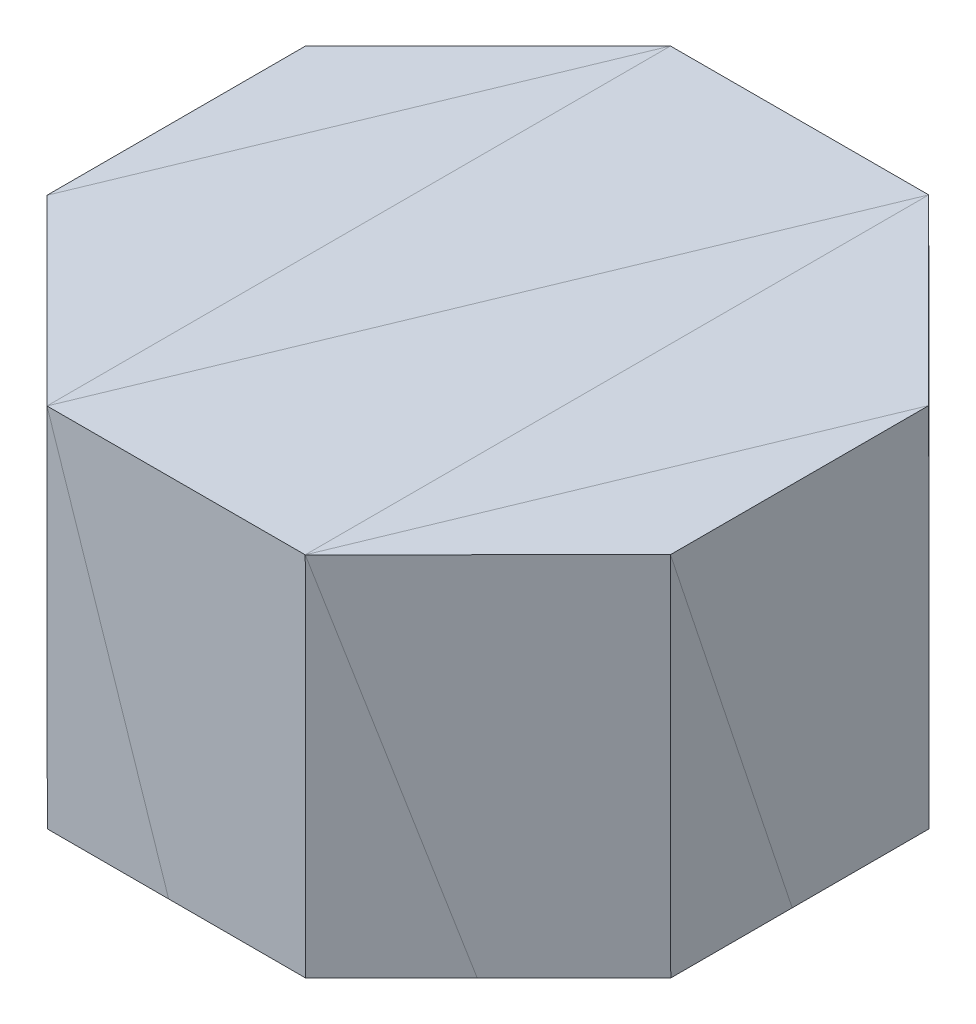
ISO-10303-21;
HEADER;
FILE_DESCRIPTION(('STEP AP214'),'2;1');
FILE_NAME('part.step','',(''),(''),'','','');
FILE_SCHEMA(('AUTOMOTIVE_DESIGN { 1 0 10303 214 1 1 1 1 }'));
ENDSEC;
DATA;
#1=APPLICATION_CONTEXT('core data for automotive mechanical design processes');
#2=APPLICATION_PROTOCOL_DEFINITION('international standard','automotive_design',2000,#1);
#3=PRODUCT_CONTEXT('',#1,'mechanical');
#4=PRODUCT('Part','Part','',(#3));
#5=PRODUCT_RELATED_PRODUCT_CATEGORY('part','',(#4));
#6=PRODUCT_DEFINITION_FORMATION('','',#4);
#7=PRODUCT_DEFINITION_CONTEXT('part definition',#1,'design');
#8=PRODUCT_DEFINITION('design','',#6,#7);
#9=PRODUCT_DEFINITION_SHAPE('','',#8);
#10=(LENGTH_UNIT() NAMED_UNIT(*) SI_UNIT(.MILLI.,.METRE.));
#11=(NAMED_UNIT(*) PLANE_ANGLE_UNIT() SI_UNIT($,.RADIAN.));
#12=(NAMED_UNIT(*) SI_UNIT($,.STERADIAN.) SOLID_ANGLE_UNIT());
#13=UNCERTAINTY_MEASURE_WITH_UNIT(LENGTH_MEASURE(1.E-05),#10,'distance_accuracy_value','');
#14=(GEOMETRIC_REPRESENTATION_CONTEXT(3) GLOBAL_UNCERTAINTY_ASSIGNED_CONTEXT((#13)) GLOBAL_UNIT_ASSIGNED_CONTEXT((#10,
#11,#12)) REPRESENTATION_CONTEXT('',''));
#15=CARTESIAN_POINT('',(0.,0.,0.));
#16=DIRECTION('',(0.,0.,1.));
#17=DIRECTION('',(1.,0.,0.));
#18=AXIS2_PLACEMENT_3D('',#15,#16,#17);
#19=CARTESIAN_POINT('',(-0.0592231518994801,74.9999668549388,0.));
#20=DIRECTION('',(-0.000789642128111586,0.999999688232606,0.));
#21=DIRECTION('',(-0.999999688232606,-0.000789642128111586,0.));
#22=AXIS2_PLACEMENT_3D('',#19,#20,#21);
#23=PLANE('',#22);
#24=DIRECTION('',(-0.999999688232606,-0.000789642128111586,0.));
#25=VECTOR('',#24,1.);
#26=CARTESIAN_POINT('',(14.0829924494028,75.011134147644,9.99999977648258));
#27=LINE('',#26,#25);
#28=CARTESIAN_POINT('',(14.0829924494028,75.011134147644,9.99999977648258));
#29=VERTEX_POINT('',#28);
#30=CARTESIAN_POINT('',(5.79872354865074,75.0045925378799,9.99999977648258));
#31=VERTEX_POINT('',#30);
#32=EDGE_CURVE('E137',#29,#31,#27,.T.);
#33=ORIENTED_EDGE('',*,*,#32,.F.);
#34=DIRECTION('',(0.,0.,1.));
#35=VECTOR('',#34,1.);
#36=CARTESIAN_POINT('',(14.0829924494028,75.011134147644,-9.99999977648258));
#37=LINE('',#36,#35);
#38=CARTESIAN_POINT('',(14.0829924494028,75.011134147644,-9.99999977648258));
#39=VERTEX_POINT('',#38);
#40=EDGE_CURVE('E208',#39,#29,#37,.T.);
#41=ORIENTED_EDGE('',*,*,#40,.F.);
#42=DIRECTION('',(0.382683329665312,0.000302182973040543,-0.923879525631844));
#43=VECTOR('',#42,1.);
#44=CARTESIAN_POINT('',(5.79872354865074,75.0045925378799,9.99999977648258));
#45=LINE('',#44,#43);
#46=EDGE_CURVE('E167',#31,#39,#45,.T.);
#47=ORIENTED_EDGE('',*,*,#46,.F.);
#48=EDGE_LOOP('',(#33,#41,#47));
#49=FACE_BOUND('',#48,.T.);
#50=ADVANCED_FACE('F34',(#49),#23,.T.);
#51=CARTESIAN_POINT('',(12.0710626178145,0.00951797525365743,12.0710672326298));
#52=DIRECTION('',(-0.70710653611534,-0.000557550128396545,-0.707106806444981));
#53=DIRECTION('',(-0.707106916351376,0.,0.707106646021693));
#54=AXIS2_PLACEMENT_3D('',#51,#52,#53);
#55=PLANE('',#54);
#56=DIRECTION('',(-0.223169281473355,0.949065030133473,0.222420863195019));
#57=VECTOR('',#56,1.);
#58=CARTESIAN_POINT('',(19.9605673551559,50.0157549977303,4.1421358473599));
#59=LINE('',#58,#57);
#60=CARTESIAN_POINT('',(16.8463148957791,63.259639123219,7.24594438072429));
#61=VERTEX_POINT('',#60);
#62=EDGE_CURVE('E151',#61,#29,#59,.T.);
#63=ORIENTED_EDGE('',*,*,#62,.F.);
#64=DIRECTION('',(0.707106916351376,0.,-0.707106646021693));
#65=VECTOR('',#64,1.);
#66=CARTESIAN_POINT('',(12.0461264180455,63.259639123219,12.0461310233275));
#67=LINE('',#66,#65);
#68=CARTESIAN_POINT('',(19.9501246157419,63.259639123219,4.1421358473599));
#69=VERTEX_POINT('',#68);
#70=EDGE_CURVE('E89',#61,#69,#67,.T.);
#71=ORIENTED_EDGE('',*,*,#70,.T.);
#72=DIRECTION('',(0.000788494981446942,-0.999999689137784,0.));
#73=VECTOR('',#72,1.);
#74=CARTESIAN_POINT('',(19.9408549815416,75.0157460570335,4.1421358473599));
#75=LINE('',#74,#73);
#76=CARTESIAN_POINT('',(19.9408549815416,75.0157460570335,4.1421358473599));
#77=VERTEX_POINT('',#76);
#78=EDGE_CURVE('E83',#77,#69,#75,.T.);
#79=ORIENTED_EDGE('',*,*,#78,.F.);
#80=DIRECTION('',(0.707106587296986,0.000556706732436522,-0.707106755927862));
#81=VECTOR('',#80,1.);
#82=CARTESIAN_POINT('',(14.0829924494028,75.011134147644,9.99999977648258));
#83=LINE('',#82,#81);
#84=EDGE_CURVE('E153',#29,#77,#83,.T.);
#85=ORIENTED_EDGE('',*,*,#84,.F.);
#86=EDGE_LOOP('',(#63,#71,#79,#85));
#87=FACE_BOUND('',#86,.T.);
#88=ADVANCED_FACE('F366',(#87),#55,.F.);
#89=CARTESIAN_POINT('',(0.,0.,9.99999977648258));
#90=DIRECTION('',(0.,0.,-1.));
#91=DIRECTION('',(-1.,0.,0.));
#92=AXIS2_PLACEMENT_3D('',#89,#90,#91);
#93=PLANE('',#92);
#94=DIRECTION('',(-0.315299108110476,0.94899234581989,0.));
#95=VECTOR('',#94,1.);
#96=CARTESIAN_POINT('',(14.1027048230171,50.0111356377602,9.99999977648258));
#97=LINE('',#96,#95);
#98=CARTESIAN_POINT('',(9.70093978121931,63.259639123219,9.99999977648258));
#99=VERTEX_POINT('',#98);
#100=EDGE_CURVE('E146',#99,#31,#97,.T.);
#101=ORIENTED_EDGE('',*,*,#100,.F.);
#102=DIRECTION('',(-1.,0.,0.));
#103=VECTOR('',#102,1.);
#104=CARTESIAN_POINT('',(-3.27994698003474,63.259639123219,9.99999977648258));
#105=LINE('',#104,#103);
#106=CARTESIAN_POINT('',(14.092258444373,63.259639123219,9.99999977648258));
#107=VERTEX_POINT('',#106);
#108=EDGE_CURVE('E132',#107,#99,#105,.T.);
#109=ORIENTED_EDGE('',*,*,#108,.F.);
#110=DIRECTION('',(0.000788494746457258,-0.999999689137969,0.));
#111=VECTOR('',#110,1.);
#112=CARTESIAN_POINT('',(14.0829924494028,75.011134147644,9.99999977648258));
#113=LINE('',#112,#111);
#114=EDGE_CURVE('E144',#29,#107,#113,.T.);
#115=ORIENTED_EDGE('',*,*,#114,.F.);
#116=ORIENTED_EDGE('',*,*,#32,.T.);
#117=EDGE_LOOP('',(#101,#109,#115,#116));
#118=FACE_BOUND('',#117,.T.);
#119=ADVANCED_FACE('F142',(#118),#93,.F.);
#120=CARTESIAN_POINT('',(12.0710626019132,0.00951797240454148,12.0710672288321));
#121=DIRECTION('',(0.707106535760899,0.000557549961954174,0.707106806799553));
#122=DIRECTION('',(0.707106916705883,0.,-0.707106645667186));
#123=AXIS2_PLACEMENT_3D('',#120,#121,#122);
#124=PLANE('',#123);
#125=DIRECTION('',(-0.707106916705883,0.,0.707106645667186));
#126=VECTOR('',#125,1.);
#127=CARTESIAN_POINT('',(12.0461264095996,63.259639123219,12.0461310269602));
#128=LINE('',#127,#126);
#129=EDGE_CURVE('E129',#61,#107,#128,.T.);
#130=ORIENTED_EDGE('',*,*,#129,.F.);
#131=ORIENTED_EDGE('',*,*,#62,.T.);
#132=ORIENTED_EDGE('',*,*,#114,.T.);
#133=EDGE_LOOP('',(#130,#131,#132));
#134=FACE_BOUND('',#133,.T.);
#135=ADVANCED_FACE('F150',(#134),#124,.T.);
#136=CARTESIAN_POINT('',(19.9999921047349,0.0157698983058275,0.));
#137=DIRECTION('',(0.999999689137784,0.000788494981446942,0.));
#138=DIRECTION('',(-0.000788494981446942,0.999999689137784,0.));
#139=AXIS2_PLACEMENT_3D('',#136,#137,#138);
#140=PLANE('',#139);
#141=DIRECTION('',(0.,0.,1.));
#142=VECTOR('',#141,1.);
#143=CARTESIAN_POINT('',(19.9501246157419,63.259639123219,0.));
#144=LINE('',#143,#142);
#145=CARTESIAN_POINT('',(19.9501246157419,63.259639123219,0.246503097697093));
#146=VERTEX_POINT('',#145);
#147=EDGE_CURVE('E94',#146,#69,#144,.T.);
#148=ORIENTED_EDGE('',*,*,#147,.F.);
#149=DIRECTION('',(0.00074847150276844,-0.949240372745852,-0.314550718549052));
#150=VECTOR('',#149,1.);
#151=CARTESIAN_POINT('',(19.9408549815416,75.0157460570335,4.1421358473599));
#152=LINE('',#151,#150);
#153=EDGE_CURVE('E219',#77,#146,#152,.T.);
#154=ORIENTED_EDGE('',*,*,#153,.F.);
#155=ORIENTED_EDGE('',*,*,#78,.T.);
#156=EDGE_LOOP('',(#148,#154,#155));
#157=FACE_BOUND('',#156,.T.);
#158=ADVANCED_FACE('F388',(#157),#140,.T.);
#159=CARTESIAN_POINT('',(-0.0590476821036765,75.0000000851236,0.));
#160=DIRECTION('',(-0.00078730218315278,0.999999690077588,0.));
#161=DIRECTION('',(-0.999999690077588,-0.00078730218315278,0.));
#162=AXIS2_PLACEMENT_3D('',#159,#160,#161);
#163=PLANE('',#162);
#164=ORIENTED_EDGE('',*,*,#84,.T.);
#165=DIRECTION('',(0.,0.,1.));
#166=VECTOR('',#165,1.);
#167=CARTESIAN_POINT('',(19.9408549815416,75.0157460570335,-4.1421358473599));
#168=LINE('',#167,#166);
#169=CARTESIAN_POINT('',(19.9408549815416,75.0157460570335,-4.1421358473599));
#170=VERTEX_POINT('',#169);
#171=EDGE_CURVE('E216',#170,#77,#168,.T.);
#172=ORIENTED_EDGE('',*,*,#171,.F.);
#173=DIRECTION('',(0.382683312162967,0.00030128750049779,-0.923879533174008));
#174=VECTOR('',#173,1.);
#175=CARTESIAN_POINT('',(14.0829924494028,75.011134147644,9.99999977648258));
#176=LINE('',#175,#174);
#177=EDGE_CURVE('E210',#29,#170,#176,.T.);
#178=ORIENTED_EDGE('',*,*,#177,.F.);
#179=EDGE_LOOP('',(#164,#172,#178));
#180=FACE_BOUND('',#179,.T.);
#181=ADVANCED_FACE('F225',(#180),#163,.T.);
#182=CARTESIAN_POINT('',(19.9999921047349,0.0157698983058275,0.));
#183=DIRECTION('',(-0.999999689137784,-0.000788494981446942,0.));
#184=DIRECTION('',(0.000788494981446942,-0.999999689137784,0.));
#185=AXIS2_PLACEMENT_3D('',#182,#183,#184);
#186=PLANE('',#185);
#187=ORIENTED_EDGE('',*,*,#153,.T.);
#188=DIRECTION('',(0.,0.,-1.));
#189=VECTOR('',#188,1.);
#190=CARTESIAN_POINT('',(19.9501246157419,63.259639123219,0.));
#191=LINE('',#190,#189);
#192=CARTESIAN_POINT('',(19.9501246157419,63.259639123219,-4.1421358473599));
#193=VERTEX_POINT('',#192);
#194=EDGE_CURVE('E230',#146,#193,#191,.T.);
#195=ORIENTED_EDGE('',*,*,#194,.T.);
#196=DIRECTION('',(0.000788494981446942,-0.999999689137784,0.));
#197=VECTOR('',#196,1.);
#198=CARTESIAN_POINT('',(19.9408549815416,75.0157460570335,-4.1421358473599));
#199=LINE('',#198,#197);
#200=EDGE_CURVE('E213',#170,#193,#199,.T.);
#201=ORIENTED_EDGE('',*,*,#200,.F.);
#202=ORIENTED_EDGE('',*,*,#171,.T.);
#203=EDGE_LOOP('',(#187,#195,#201,#202));
#204=FACE_BOUND('',#203,.T.);
#205=ADVANCED_FACE('F228',(#204),#186,.F.);
#206=CARTESIAN_POINT('',(12.0710626077857,0.00951797524574976,-12.0710672347068));
#207=DIRECTION('',(0.707106535760768,0.000557550128116967,-0.707106806799553));
#208=DIRECTION('',(-0.707106916705948,0.,-0.707106645667121));
#209=AXIS2_PLACEMENT_3D('',#206,#207,#208);
#210=PLANE('',#209);
#211=DIRECTION('',(0.707106916705948,0.,0.707106645667121));
#212=VECTOR('',#211,1.);
#213=CARTESIAN_POINT('',(12.0461264080417,63.259639123219,-12.0461310254045));
#214=LINE('',#213,#212);
#215=CARTESIAN_POINT('',(17.1960044756374,63.259639123219,-6.89625493179163));
#216=VERTEX_POINT('',#215);
#217=EDGE_CURVE('E234',#216,#193,#214,.T.);
#218=ORIENTED_EDGE('',*,*,#217,.F.);
#219=DIRECTION('',(-0.221672390943262,-0.94941576111259,-0.222420915483458));
#220=VECTOR('',#219,1.);
#221=CARTESIAN_POINT('',(19.9408549815416,75.0157460570335,-4.1421358473599));
#222=LINE('',#221,#220);
#223=EDGE_CURVE('E205',#170,#216,#222,.T.);
#224=ORIENTED_EDGE('',*,*,#223,.F.);
#225=ORIENTED_EDGE('',*,*,#200,.T.);
#226=EDGE_LOOP('',(#218,#224,#225));
#227=FACE_BOUND('',#226,.T.);
#228=ADVANCED_FACE('F233',(#227),#210,.T.);
#229=CARTESIAN_POINT('',(-0.0590476821036765,75.0000000851236,0.));
#230=DIRECTION('',(0.00078730218315278,-0.999999690077588,0.));
#231=DIRECTION('',(0.999999690077588,0.00078730218315278,0.));
#232=AXIS2_PLACEMENT_3D('',#229,#230,#231);
#233=PLANE('',#232);
#234=ORIENTED_EDGE('',*,*,#40,.T.);
#235=ORIENTED_EDGE('',*,*,#177,.T.);
#236=DIRECTION('',(0.707106587296986,0.000556706732436522,0.707106755927862));
#237=VECTOR('',#236,1.);
#238=CARTESIAN_POINT('',(14.0829924494028,75.011134147644,-9.99999977648258));
#239=LINE('',#238,#237);
#240=EDGE_CURVE('E202',#39,#170,#239,.T.);
#241=ORIENTED_EDGE('',*,*,#240,.F.);
#242=EDGE_LOOP('',(#234,#235,#241));
#243=FACE_BOUND('',#242,.T.);
#244=ADVANCED_FACE('F242',(#243),#233,.F.);
#245=CARTESIAN_POINT('',(12.0710626090047,0.00951797241013305,-12.0710672238177));
#246=DIRECTION('',(-0.707106536115471,-0.000557549962233752,0.707106806444981));
#247=DIRECTION('',(0.707106916351311,0.,0.707106646021759));
#248=AXIS2_PLACEMENT_3D('',#245,#246,#247);
#249=PLANE('',#248);
#250=ORIENTED_EDGE('',*,*,#223,.T.);
#251=DIRECTION('',(-0.707106916351311,0.,-0.707106646021759));
#252=VECTOR('',#251,1.);
#253=CARTESIAN_POINT('',(12.046126416666,63.259639123219,-12.0461310219458));
#254=LINE('',#253,#252);
#255=CARTESIAN_POINT('',(14.092258444373,63.259639123219,-9.99999977648258));
#256=VERTEX_POINT('',#255);
#257=EDGE_CURVE('E239',#216,#256,#254,.T.);
#258=ORIENTED_EDGE('',*,*,#257,.T.);
#259=DIRECTION('',(0.000788494746457258,-0.999999689137969,0.));
#260=VECTOR('',#259,1.);
#261=CARTESIAN_POINT('',(14.0829924494028,75.011134147644,-9.99999977648258));
#262=LINE('',#261,#260);
#263=EDGE_CURVE('E199',#39,#256,#262,.T.);
#264=ORIENTED_EDGE('',*,*,#263,.F.);
#265=ORIENTED_EDGE('',*,*,#240,.T.);
#266=EDGE_LOOP('',(#250,#258,#264,#265));
#267=FACE_BOUND('',#266,.T.);
#268=ADVANCED_FACE('F237',(#267),#249,.F.);
#269=CARTESIAN_POINT('',(0.,0.,-9.99999977648258));
#270=DIRECTION('',(0.,0.,-1.));
#271=DIRECTION('',(-1.,0.,0.));
#272=AXIS2_PLACEMENT_3D('',#269,#270,#271);
#273=PLANE('',#272);
#274=DIRECTION('',(-1.,0.,0.));
#275=VECTOR('',#274,1.);
#276=CARTESIAN_POINT('',(-3.27994698003474,63.259639123219,-9.99999977648258));
#277=LINE('',#276,#275);
#278=CARTESIAN_POINT('',(10.1991713808464,63.259639123219,-9.99999977648258));
#279=VERTEX_POINT('',#278);
#280=EDGE_CURVE('E247',#256,#279,#277,.T.);
#281=ORIENTED_EDGE('',*,*,#280,.T.);
#282=DIRECTION('',(-0.313802044533206,-0.94948842902206,0.));
#283=VECTOR('',#282,1.);
#284=CARTESIAN_POINT('',(14.0829924494028,75.011134147644,-9.99999977648258));
#285=LINE('',#284,#283);
#286=EDGE_CURVE('E195',#39,#279,#285,.T.);
#287=ORIENTED_EDGE('',*,*,#286,.F.);
#288=ORIENTED_EDGE('',*,*,#263,.T.);
#289=EDGE_LOOP('',(#281,#287,#288));
#290=FACE_BOUND('',#289,.T.);
#291=ADVANCED_FACE('F246',(#290),#273,.T.);
#292=CARTESIAN_POINT('',(-0.0592231518994801,74.9999668549388,0.));
#293=DIRECTION('',(0.000789642128111586,-0.999999688232606,0.));
#294=DIRECTION('',(0.999999688232606,0.000789642128111586,0.));
#295=AXIS2_PLACEMENT_3D('',#292,#293,#294);
#296=PLANE('',#295);
#297=DIRECTION('',(0.,0.,-1.));
#298=VECTOR('',#297,1.);
#299=CARTESIAN_POINT('',(5.79872354865074,75.0045925378799,9.99999977648258));
#300=LINE('',#299,#298);
#301=CARTESIAN_POINT('',(5.79872354865074,75.0045925378799,-9.99999977648258));
#302=VERTEX_POINT('',#301);
#303=EDGE_CURVE('E164',#31,#302,#300,.T.);
#304=ORIENTED_EDGE('',*,*,#303,.F.);
#305=ORIENTED_EDGE('',*,*,#46,.T.);
#306=DIRECTION('',(0.999999688232606,0.000789642128111586,0.));
#307=VECTOR('',#306,1.);
#308=CARTESIAN_POINT('',(5.79872354865074,75.0045925378799,-9.99999977648258));
#309=LINE('',#308,#307);
#310=EDGE_CURVE('E169',#302,#39,#309,.T.);
#311=ORIENTED_EDGE('',*,*,#310,.F.);
#312=EDGE_LOOP('',(#304,#305,#311));
#313=FACE_BOUND('',#312,.T.);
#314=ADVANCED_FACE('F166',(#313),#296,.F.);
#315=CARTESIAN_POINT('',(0.,0.,-9.99999977648258));
#316=DIRECTION('',(0.,0.,1.));
#317=DIRECTION('',(1.,0.,0.));
#318=AXIS2_PLACEMENT_3D('',#315,#316,#317);
#319=PLANE('',#318);
#320=ORIENTED_EDGE('',*,*,#286,.T.);
#321=CARTESIAN_POINT('',(5.80798482726818,63.259639123219,-9.99999977648258));
#322=VERTEX_POINT('',#321);
#323=EDGE_CURVE('E147',#279,#322,#277,.T.);
#324=ORIENTED_EDGE('',*,*,#323,.T.);
#325=DIRECTION('',(0.000788532351828952,-0.999999689108317,0.));
#326=VECTOR('',#325,1.);
#327=CARTESIAN_POINT('',(5.79872354865074,75.0045925378799,-9.99999977648258));
#328=LINE('',#327,#326);
#329=EDGE_CURVE('E191',#302,#322,#328,.T.);
#330=ORIENTED_EDGE('',*,*,#329,.F.);
#331=ORIENTED_EDGE('',*,*,#310,.T.);
#332=EDGE_LOOP('',(#320,#324,#330,#331));
#333=FACE_BOUND('',#332,.T.);
#334=ADVANCED_FACE('F250',(#333),#319,.F.);
#335=CARTESIAN_POINT('',(-2.0710669206932,-0.00163310377748774,-2.07106779306777));
#336=DIRECTION('',(-0.707106522346081,-0.000557576542405056,-0.707106820193407));
#337=DIRECTION('',(-0.707106930110218,0.,0.707106632262845));
#338=AXIS2_PLACEMENT_3D('',#335,#336,#337);
#339=PLANE('',#338);
#340=DIRECTION('',(0.707106930110218,0.,-0.707106632262845));
#341=VECTOR('',#340,1.);
#342=CARTESIAN_POINT('',(-2.09600869782584,63.259639123219,-2.09600958070638));
#343=LINE('',#342,#341);
#344=CARTESIAN_POINT('',(3.05647712394585,63.259639123219,-7.24849323214951));
#345=VERTEX_POINT('',#344);
#346=EDGE_CURVE('E255',#345,#322,#343,.T.);
#347=ORIENTED_EDGE('',*,*,#346,.F.);
#348=DIRECTION('',(-0.221672395099996,-0.949415752833357,0.222420946681064));
#349=VECTOR('',#348,1.);
#350=CARTESIAN_POINT('',(5.79872354865074,75.0045925378799,-9.99999977648258));
#351=LINE('',#350,#349);
#352=EDGE_CURVE('E257',#302,#345,#351,.T.);
#353=ORIENTED_EDGE('',*,*,#352,.F.);
#354=ORIENTED_EDGE('',*,*,#329,.T.);
#355=EDGE_LOOP('',(#347,#353,#354));
#356=FACE_BOUND('',#355,.T.);
#357=ADVANCED_FACE('F254',(#356),#339,.T.);
#358=CARTESIAN_POINT('',(0.,0.,9.99999977648258));
#359=DIRECTION('',(0.,0.,1.));
#360=DIRECTION('',(1.,0.,0.));
#361=AXIS2_PLACEMENT_3D('',#358,#359,#360);
#362=PLANE('',#361);
#363=CARTESIAN_POINT('',(5.80798482726818,63.259639123219,9.99999977648258));
#364=VERTEX_POINT('',#363);
#365=EDGE_CURVE('E148',#99,#364,#105,.T.);
#366=ORIENTED_EDGE('',*,*,#365,.F.);
#367=ORIENTED_EDGE('',*,*,#100,.T.);
#368=DIRECTION('',(-0.000788532351828952,0.999999689108317,0.));
#369=VECTOR('',#368,1.);
#370=CARTESIAN_POINT('',(5.81843685358763,50.004605203867,9.99999977648258));
#371=LINE('',#370,#369);
#372=EDGE_CURVE('E174',#364,#31,#371,.T.);
#373=ORIENTED_EDGE('',*,*,#372,.F.);
#374=EDGE_LOOP('',(#366,#367,#373));
#375=FACE_BOUND('',#374,.T.);
#376=ADVANCED_FACE('F295',(#375),#362,.T.);
#377=CARTESIAN_POINT('',(-0.0590476681621012,74.9999807002801,0.));
#378=DIRECTION('',(0.000787302200754888,-0.999999690077574,0.));
#379=DIRECTION('',(0.999999690077574,0.000787302200754889,0.));
#380=AXIS2_PLACEMENT_3D('',#377,#378,#379);
#381=PLANE('',#380);
#382=DIRECTION('',(-0.707106579392409,-0.000556706738659807,-0.707106763832432));
#383=VECTOR('',#382,1.);
#384=CARTESIAN_POINT('',(5.79872354865074,75.0045925378799,9.99999977648258));
#385=LINE('',#384,#383);
#386=CARTESIAN_POINT('',(-0.059138852520846,74.9999806284904,4.1421358473599));
#387=VERTEX_POINT('',#386);
#388=EDGE_CURVE('E177',#31,#387,#385,.T.);
#389=ORIENTED_EDGE('',*,*,#388,.F.);
#390=ORIENTED_EDGE('',*,*,#303,.T.);
#391=DIRECTION('',(0.382683304860094,0.000301287501484259,-0.923879536198956));
#392=VECTOR('',#391,1.);
#393=CARTESIAN_POINT('',(-0.0591388525208458,74.9999806284904,4.1421358473599));
#394=LINE('',#393,#392);
#395=EDGE_CURVE('E179',#387,#302,#394,.T.);
#396=ORIENTED_EDGE('',*,*,#395,.F.);
#397=EDGE_LOOP('',(#389,#390,#396));
#398=FACE_BOUND('',#397,.T.);
#399=ADVANCED_FACE('F178',(#398),#381,.F.);
#400=CARTESIAN_POINT('',(-2.07106674131383,-0.00163310363604125,2.07106748684792));
#401=DIRECTION('',(0.707106543999087,0.000557576559479158,-0.707106798540395));
#402=DIRECTION('',(-0.70710690845721,0.,-0.707106653915862));
#403=AXIS2_PLACEMENT_3D('',#400,#401,#402);
#404=PLANE('',#403);
#405=DIRECTION('',(-0.223169340307992,0.949065009654656,-0.22242089154507));
#406=VECTOR('',#405,1.);
#407=CARTESIAN_POINT('',(5.81843685358763,50.004605203867,9.99999977648258));
#408=LINE('',#407,#406);
#409=CARTESIAN_POINT('',(2.70156167069764,63.259639123219,6.89357773814909));
#410=VERTEX_POINT('',#409);
#411=EDGE_CURVE('E184',#410,#387,#408,.T.);
#412=ORIENTED_EDGE('',*,*,#411,.F.);
#413=DIRECTION('',(0.70710690845721,0.,0.707106653915862));
#414=VECTOR('',#413,1.);
#415=CARTESIAN_POINT('',(-2.09600851997395,63.259639123219,2.09600927448648));
#416=LINE('',#415,#414);
#417=EDGE_CURVE('E284',#410,#364,#416,.T.);
#418=ORIENTED_EDGE('',*,*,#417,.T.);
#419=ORIENTED_EDGE('',*,*,#372,.T.);
#420=ORIENTED_EDGE('',*,*,#388,.T.);
#421=EDGE_LOOP('',(#412,#418,#419,#420));
#422=FACE_BOUND('',#421,.T.);
#423=ADVANCED_FACE('F294',(#422),#404,.F.);
#424=CARTESIAN_POINT('',(-2.07106727947532,-0.00163307433983438,2.0710681518266));
#425=DIRECTION('',(-0.707106522354082,-0.000557566395176945,0.707106820193407));
#426=DIRECTION('',(0.707106930106217,0.,0.707106632266846));
#427=AXIS2_PLACEMENT_3D('',#424,#425,#426);
#428=PLANE('',#427);
#429=DIRECTION('',(-0.707106930106217,0.,-0.707106632266846));
#430=VECTOR('',#429,1.);
#431=CARTESIAN_POINT('',(-2.09600860268576,63.259639123219,2.09600948554253));
#432=LINE('',#431,#430);
#433=CARTESIAN_POINT('',(-0.0498813790224433,63.259639123219,4.1421358473599));
#434=VERTEX_POINT('',#433);
#435=EDGE_CURVE('E287',#410,#434,#432,.T.);
#436=ORIENTED_EDGE('',*,*,#435,.F.);
#437=ORIENTED_EDGE('',*,*,#411,.T.);
#438=DIRECTION('',(-0.000788518001480544,0.999999689119632,0.));
#439=VECTOR('',#438,1.);
#440=CARTESIAN_POINT('',(-0.0394259004679043,49.9999858438969,4.1421358473599));
#441=LINE('',#440,#439);
#442=EDGE_CURVE('E266',#434,#387,#441,.T.);
#443=ORIENTED_EDGE('',*,*,#442,.F.);
#444=EDGE_LOOP('',(#436,#437,#443));
#445=FACE_BOUND('',#444,.T.);
#446=ADVANCED_FACE('F320',(#445),#428,.T.);
#447=CARTESIAN_POINT('',(-0.0590476681621012,74.9999807002801,0.));
#448=DIRECTION('',(0.000787302200754888,-0.999999690077574,0.));
#449=DIRECTION('',(0.999999690077574,0.000787302200754888,0.));
#450=AXIS2_PLACEMENT_3D('',#447,#448,#449);
#451=PLANE('',#450);
#452=DIRECTION('',(0.,0.,-1.));
#453=VECTOR('',#452,1.);
#454=CARTESIAN_POINT('',(-0.0591388525208458,74.9999806284904,4.1421358473599));
#455=LINE('',#454,#453);
#456=CARTESIAN_POINT('',(-0.0591388525208458,74.9999806284904,-4.1421358473599));
#457=VERTEX_POINT('',#456);
#458=EDGE_CURVE('E262',#387,#457,#455,.T.);
#459=ORIENTED_EDGE('',*,*,#458,.F.);
#460=ORIENTED_EDGE('',*,*,#395,.T.);
#461=DIRECTION('',(0.707106579392409,0.000556706738659807,-0.707106763832432));
#462=VECTOR('',#461,1.);
#463=CARTESIAN_POINT('',(-0.0591388525208458,74.9999806284904,-4.1421358473599));
#464=LINE('',#463,#462);
#465=EDGE_CURVE('E261',#457,#302,#464,.T.);
#466=ORIENTED_EDGE('',*,*,#465,.F.);
#467=EDGE_LOOP('',(#459,#460,#466));
#468=FACE_BOUND('',#467,.T.);
#469=ADVANCED_FACE('F272',(#468),#451,.F.);
#470=CARTESIAN_POINT('',(7.00519001135164E-10,5.52372014495861E-13,0.));
#471=DIRECTION('',(0.999999689119632,0.000788518001480544,0.));
#472=DIRECTION('',(-0.000788518001480544,0.999999689119632,0.));
#473=AXIS2_PLACEMENT_3D('',#470,#471,#472);
#474=PLANE('',#473);
#475=DIRECTION('',(-0.000748493365357289,0.949240386725483,-0.314550676309776));
#476=VECTOR('',#475,1.);
#477=CARTESIAN_POINT('',(-0.0394259004679043,49.9999858438969,4.1421358473599));
#478=LINE('',#477,#476);
#479=CARTESIAN_POINT('',(-0.0498813790224433,63.259639123219,-0.251727883018971));
#480=VERTEX_POINT('',#479);
#481=EDGE_CURVE('E55',#480,#457,#478,.T.);
#482=ORIENTED_EDGE('',*,*,#481,.F.);
#483=DIRECTION('',(0.,0.,1.));
#484=VECTOR('',#483,1.);
#485=CARTESIAN_POINT('',(-0.0498813790224433,63.259639123219,0.));
#486=LINE('',#485,#484);
#487=EDGE_CURVE('E47',#480,#434,#486,.T.);
#488=ORIENTED_EDGE('',*,*,#487,.T.);
#489=ORIENTED_EDGE('',*,*,#442,.T.);
#490=ORIENTED_EDGE('',*,*,#458,.T.);
#491=EDGE_LOOP('',(#482,#488,#489,#490));
#492=FACE_BOUND('',#491,.T.);
#493=ADVANCED_FACE('F312',(#492),#474,.F.);
#494=CARTESIAN_POINT('',(-2.07106727947533,-0.00163307433983439,-2.07106802498622));
#495=DIRECTION('',(0.707106544007082,0.00055756641225073,0.707106798540402));
#496=DIRECTION('',(0.707106908453215,0.,-0.707106653919857));
#497=AXIS2_PLACEMENT_3D('',#494,#495,#496);
#498=PLANE('',#497);
#499=ORIENTED_EDGE('',*,*,#352,.T.);
#500=DIRECTION('',(-0.707106908453215,0.,0.707106653919857));
#501=VECTOR('',#500,1.);
#502=CARTESIAN_POINT('',(-2.09600860421327,63.259639123219,-2.09600935870216));
#503=LINE('',#502,#501);
#504=CARTESIAN_POINT('',(-0.0498813790224433,63.259639123219,-4.1421358473599));
#505=VERTEX_POINT('',#504);
#506=EDGE_CURVE('E275',#345,#505,#503,.T.);
#507=ORIENTED_EDGE('',*,*,#506,.T.);
#508=DIRECTION('',(0.000788518001480544,-0.999999689119632,0.));
#509=VECTOR('',#508,1.);
#510=CARTESIAN_POINT('',(-0.0591388525208458,74.9999806284904,-4.1421358473599));
#511=LINE('',#510,#509);
#512=EDGE_CURVE('E41',#457,#505,#511,.T.);
#513=ORIENTED_EDGE('',*,*,#512,.F.);
#514=ORIENTED_EDGE('',*,*,#465,.T.);
#515=EDGE_LOOP('',(#499,#507,#513,#514));
#516=FACE_BOUND('',#515,.T.);
#517=ADVANCED_FACE('F274',(#516),#498,.F.);
#518=CARTESIAN_POINT('',(7.00518994358902E-10,5.52372009152656E-13,0.));
#519=DIRECTION('',(-0.999999689119632,-0.000788518001480544,0.));
#520=DIRECTION('',(0.000788518001480544,-0.999999689119632,0.));
#521=AXIS2_PLACEMENT_3D('',#518,#519,#520);
#522=PLANE('',#521);
#523=DIRECTION('',(0.,0.,-1.));
#524=VECTOR('',#523,1.);
#525=CARTESIAN_POINT('',(-0.0498813790224433,63.259639123219,0.));
#526=LINE('',#525,#524);
#527=EDGE_CURVE('E11',#480,#505,#526,.T.);
#528=ORIENTED_EDGE('',*,*,#527,.F.);
#529=ORIENTED_EDGE('',*,*,#481,.T.);
#530=ORIENTED_EDGE('',*,*,#512,.T.);
#531=EDGE_LOOP('',(#528,#529,#530));
#532=FACE_BOUND('',#531,.T.);
#533=ADVANCED_FACE('F304',(#532),#522,.T.);
#534=CARTESIAN_POINT('',(-3.27994698003474,63.259639123219,-9.99999977648258));
#535=DIRECTION('',(0.,1.,0.));
#536=DIRECTION('',(0.,0.,1.));
#537=AXIS2_PLACEMENT_3D('',#534,#535,#536);
#538=PLANE('',#537);
#539=ORIENTED_EDGE('',*,*,#129,.T.);
#540=ORIENTED_EDGE('',*,*,#108,.T.);
#541=ORIENTED_EDGE('',*,*,#365,.T.);
#542=ORIENTED_EDGE('',*,*,#417,.F.);
#543=ORIENTED_EDGE('',*,*,#435,.T.);
#544=ORIENTED_EDGE('',*,*,#487,.F.);
#545=ORIENTED_EDGE('',*,*,#527,.T.);
#546=ORIENTED_EDGE('',*,*,#506,.F.);
#547=ORIENTED_EDGE('',*,*,#346,.T.);
#548=ORIENTED_EDGE('',*,*,#323,.F.);
#549=ORIENTED_EDGE('',*,*,#280,.F.);
#550=ORIENTED_EDGE('',*,*,#257,.F.);
#551=ORIENTED_EDGE('',*,*,#217,.T.);
#552=ORIENTED_EDGE('',*,*,#194,.F.);
#553=ORIENTED_EDGE('',*,*,#147,.T.);
#554=ORIENTED_EDGE('',*,*,#70,.F.);
#555=EDGE_LOOP('',(#539,#540,#541,#542,#543,#544,#545,#546,#547,#548,#549,#550,#551,#552,#553,#554));
#556=FACE_BOUND('',#555,.T.);
#557=ADVANCED_FACE('F131',(#556),#538,.F.);
#558=CLOSED_SHELL('',(#50,#88,#119,#135,#158,#181,#205,#228,#244,#268,#291,#314,#334,#357,#376,
#399,#423,#446,#469,#493,#517,#533,#557));
#559=MANIFOLD_SOLID_BREP('B2',#558);
#560=ADVANCED_BREP_SHAPE_REPRESENTATION('',(#18,#559),#14);
#561=SHAPE_DEFINITION_REPRESENTATION(#9,#560);
ENDSEC;
END-ISO-10303-21;
